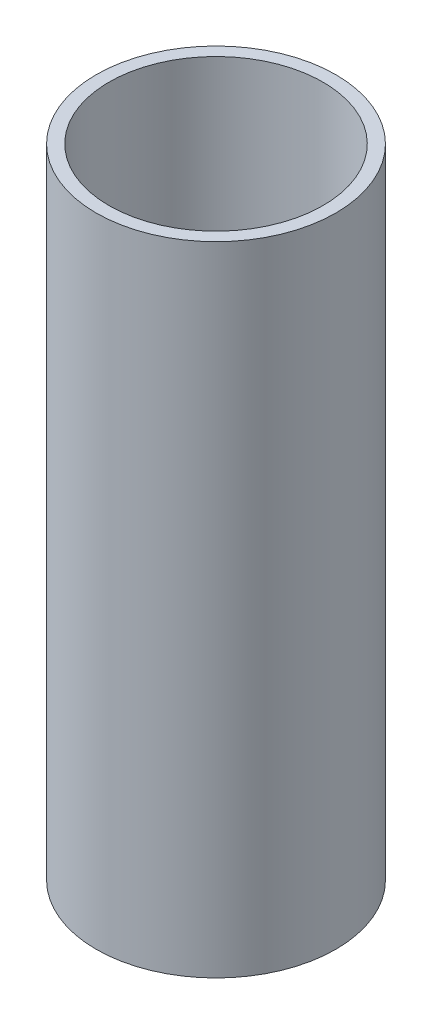
ISO-10303-21;
HEADER;
FILE_DESCRIPTION(('STEP AP214'),'2;1');
FILE_NAME('part.step','',(''),(''),'','','');
FILE_SCHEMA(('AUTOMOTIVE_DESIGN { 1 0 10303 214 1 1 1 1 }'));
ENDSEC;
DATA;
#1=APPLICATION_CONTEXT('core data for automotive mechanical design processes');
#2=APPLICATION_PROTOCOL_DEFINITION('international standard','automotive_design',2000,#1);
#3=PRODUCT_CONTEXT('',#1,'mechanical');
#4=PRODUCT('Part','Part','',(#3));
#5=PRODUCT_RELATED_PRODUCT_CATEGORY('part','',(#4));
#6=PRODUCT_DEFINITION_FORMATION('','',#4);
#7=PRODUCT_DEFINITION_CONTEXT('part definition',#1,'design');
#8=PRODUCT_DEFINITION('design','',#6,#7);
#9=PRODUCT_DEFINITION_SHAPE('','',#8);
#10=(LENGTH_UNIT() NAMED_UNIT(*) SI_UNIT(.MILLI.,.METRE.));
#11=(NAMED_UNIT(*) PLANE_ANGLE_UNIT() SI_UNIT($,.RADIAN.));
#12=(NAMED_UNIT(*) SI_UNIT($,.STERADIAN.) SOLID_ANGLE_UNIT());
#13=UNCERTAINTY_MEASURE_WITH_UNIT(LENGTH_MEASURE(1.E-05),#10,'distance_accuracy_value','');
#14=(GEOMETRIC_REPRESENTATION_CONTEXT(3) GLOBAL_UNCERTAINTY_ASSIGNED_CONTEXT((#13)) GLOBAL_UNIT_ASSIGNED_CONTEXT((#10,
#11,#12)) REPRESENTATION_CONTEXT('',''));
#15=CARTESIAN_POINT('',(0.,0.,0.));
#16=DIRECTION('',(0.,0.,1.));
#17=DIRECTION('',(1.,0.,0.));
#18=AXIS2_PLACEMENT_3D('',#15,#16,#17);
#19=CARTESIAN_POINT('',(0.,65.18575,0.));
#20=DIRECTION('',(0.,1.,0.));
#21=DIRECTION('',(0.,0.,1.));
#22=AXIS2_PLACEMENT_3D('',#19,#20,#21);
#23=PLANE('',#22);
#24=CARTESIAN_POINT('',(0.,65.18575,0.));
#25=DIRECTION('',(0.,1.,0.));
#26=DIRECTION('',(0.,0.,1.));
#27=AXIS2_PLACEMENT_3D('',#24,#25,#26);
#28=CIRCLE('',#27,10.5);
#29=CARTESIAN_POINT('',(0.,65.18575,10.5));
#30=VERTEX_POINT('',#29);
#31=EDGE_CURVE('E10',#30,#30,#28,.T.);
#32=ORIENTED_EDGE('',*,*,#31,.T.);
#33=EDGE_LOOP('',(#32));
#34=FACE_BOUND('',#33,.T.);
#35=CARTESIAN_POINT('',(0.,65.18575,0.));
#36=DIRECTION('',(0.,1.,0.));
#37=DIRECTION('',(0.,0.,1.));
#38=AXIS2_PLACEMENT_3D('',#35,#36,#37);
#39=CIRCLE('',#38,9.375);
#40=CARTESIAN_POINT('',(0.,65.18575,9.375));
#41=VERTEX_POINT('',#40);
#42=EDGE_CURVE('E44',#41,#41,#39,.T.);
#43=ORIENTED_EDGE('',*,*,#42,.F.);
#44=EDGE_LOOP('',(#43));
#45=FACE_BOUND('',#44,.T.);
#46=ADVANCED_FACE('F33',(#34,#45),#23,.T.);
#47=CARTESIAN_POINT('',(0.,9.31225,0.));
#48=DIRECTION('',(0.,1.,0.));
#49=DIRECTION('',(0.,0.,1.));
#50=AXIS2_PLACEMENT_3D('',#47,#48,#49);
#51=PLANE('',#50);
#52=CARTESIAN_POINT('',(0.,9.31225,0.));
#53=DIRECTION('',(0.,1.,0.));
#54=DIRECTION('',(0.,0.,1.));
#55=AXIS2_PLACEMENT_3D('',#52,#53,#54);
#56=CIRCLE('',#55,10.5);
#57=CARTESIAN_POINT('',(0.,9.31225,10.5));
#58=VERTEX_POINT('',#57);
#59=EDGE_CURVE('E37',#58,#58,#56,.T.);
#60=ORIENTED_EDGE('',*,*,#59,.F.);
#61=EDGE_LOOP('',(#60));
#62=FACE_BOUND('',#61,.T.);
#63=CARTESIAN_POINT('',(0.,9.31225,0.));
#64=DIRECTION('',(0.,1.,0.));
#65=DIRECTION('',(0.,0.,1.));
#66=AXIS2_PLACEMENT_3D('',#63,#64,#65);
#67=CIRCLE('',#66,9.375);
#68=CARTESIAN_POINT('',(0.,9.31225,9.375));
#69=VERTEX_POINT('',#68);
#70=EDGE_CURVE('E46',#69,#69,#67,.T.);
#71=ORIENTED_EDGE('',*,*,#70,.T.);
#72=EDGE_LOOP('',(#71));
#73=FACE_BOUND('',#72,.T.);
#74=ADVANCED_FACE('F56',(#62,#73),#51,.F.);
#75=CARTESIAN_POINT('',(0.,65.18575,0.));
#76=DIRECTION('',(0.,-1.,0.));
#77=DIRECTION('',(0.,0.,-1.));
#78=AXIS2_PLACEMENT_3D('',#75,#76,#77);
#79=CYLINDRICAL_SURFACE('',#78,10.5);
#80=ORIENTED_EDGE('',*,*,#31,.F.);
#81=EDGE_LOOP('',(#80));
#82=FACE_BOUND('',#81,.T.);
#83=ORIENTED_EDGE('',*,*,#59,.T.);
#84=EDGE_LOOP('',(#83));
#85=FACE_BOUND('',#84,.T.);
#86=ADVANCED_FACE('F35',(#82,#85),#79,.T.);
#87=CARTESIAN_POINT('',(0.,65.18575,0.));
#88=DIRECTION('',(0.,-1.,0.));
#89=DIRECTION('',(0.,0.,-1.));
#90=AXIS2_PLACEMENT_3D('',#87,#88,#89);
#91=CYLINDRICAL_SURFACE('',#90,9.375);
#92=ORIENTED_EDGE('',*,*,#42,.T.);
#93=EDGE_LOOP('',(#92));
#94=FACE_BOUND('',#93,.T.);
#95=ORIENTED_EDGE('',*,*,#70,.F.);
#96=EDGE_LOOP('',(#95));
#97=FACE_BOUND('',#96,.T.);
#98=ADVANCED_FACE('F52',(#94,#97),#91,.F.);
#99=CLOSED_SHELL('',(#46,#74,#86,#98));
#100=MANIFOLD_SOLID_BREP('B2',#99);
#101=ADVANCED_BREP_SHAPE_REPRESENTATION('',(#18,#100),#14);
#102=SHAPE_DEFINITION_REPRESENTATION(#9,#101);
ENDSEC;
END-ISO-10303-21;
